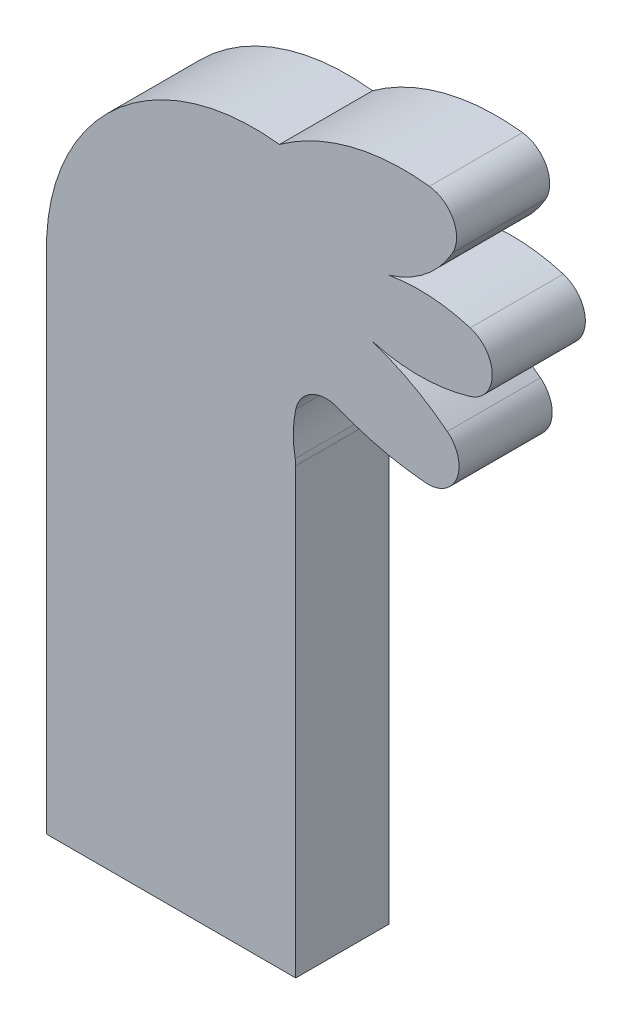
ISO-10303-21;
HEADER;
FILE_DESCRIPTION(('STEP AP214'),'2;1');
FILE_NAME('part.step','',(''),(''),'','','');
FILE_SCHEMA(('AUTOMOTIVE_DESIGN { 1 0 10303 214 1 1 1 1 }'));
ENDSEC;
DATA;
#1=APPLICATION_CONTEXT('core data for automotive mechanical design processes');
#2=APPLICATION_PROTOCOL_DEFINITION('international standard','automotive_design',2000,#1);
#3=PRODUCT_CONTEXT('',#1,'mechanical');
#4=PRODUCT('Part','Part','',(#3));
#5=PRODUCT_RELATED_PRODUCT_CATEGORY('part','',(#4));
#6=PRODUCT_DEFINITION_FORMATION('','',#4);
#7=PRODUCT_DEFINITION_CONTEXT('part definition',#1,'design');
#8=PRODUCT_DEFINITION('design','',#6,#7);
#9=PRODUCT_DEFINITION_SHAPE('','',#8);
#10=(LENGTH_UNIT() NAMED_UNIT(*) SI_UNIT(.MILLI.,.METRE.));
#11=(NAMED_UNIT(*) PLANE_ANGLE_UNIT() SI_UNIT($,.RADIAN.));
#12=(NAMED_UNIT(*) SI_UNIT($,.STERADIAN.) SOLID_ANGLE_UNIT());
#13=UNCERTAINTY_MEASURE_WITH_UNIT(LENGTH_MEASURE(1.E-05),#10,'distance_accuracy_value','');
#14=(GEOMETRIC_REPRESENTATION_CONTEXT(3) GLOBAL_UNCERTAINTY_ASSIGNED_CONTEXT((#13)) GLOBAL_UNIT_ASSIGNED_CONTEXT((#10,
#11,#12)) REPRESENTATION_CONTEXT('',''));
#15=CARTESIAN_POINT('',(0.,0.,0.));
#16=DIRECTION('',(0.,0.,1.));
#17=DIRECTION('',(1.,0.,0.));
#18=AXIS2_PLACEMENT_3D('',#15,#16,#17);
#19=CARTESIAN_POINT('',(13.7145077739251,-21.6016683174806,3.));
#20=DIRECTION('',(0.,0.,-1.));
#21=DIRECTION('',(-1.,0.,0.));
#22=AXIS2_PLACEMENT_3D('',#19,#20,#21);
#23=CYLINDRICAL_SURFACE('',#22,5.70087712549573);
#24=CARTESIAN_POINT('',(13.7145077739251,-21.6016683174806,0.));
#25=DIRECTION('',(0.,0.,1.));
#26=DIRECTION('',(1.,0.,0.));
#27=AXIS2_PLACEMENT_3D('',#24,#25,#26);
#28=CIRCLE('',#27,5.70087712549573);
#29=CARTESIAN_POINT('',(12.2145077739251,-27.1016683174806,0.));
#30=VERTEX_POINT('',#29);
#31=CARTESIAN_POINT('',(15.3632115742729,-27.0589364782657,0.));
#32=VERTEX_POINT('',#31);
#33=EDGE_CURVE('E178',#30,#32,#28,.T.);
#34=ORIENTED_EDGE('',*,*,#33,.T.);
#35=DIRECTION('',(0.,0.,-1.));
#36=VECTOR('',#35,1.);
#37=CARTESIAN_POINT('',(15.3632115742729,-27.0589364782657,3.));
#38=LINE('',#37,#36);
#39=CARTESIAN_POINT('',(15.3632115742729,-27.0589364782657,3.));
#40=VERTEX_POINT('',#39);
#41=EDGE_CURVE('E11',#40,#32,#38,.T.);
#42=ORIENTED_EDGE('',*,*,#41,.F.);
#43=CARTESIAN_POINT('',(13.7145077739251,-21.6016683174806,3.));
#44=DIRECTION('',(0.,0.,1.));
#45=DIRECTION('',(1.,0.,0.));
#46=AXIS2_PLACEMENT_3D('',#43,#44,#45);
#47=CIRCLE('',#46,5.70087712549573);
#48=CARTESIAN_POINT('',(12.2145077739251,-27.1016683174806,3.));
#49=VERTEX_POINT('',#48);
#50=EDGE_CURVE('E208',#49,#40,#47,.T.);
#51=ORIENTED_EDGE('',*,*,#50,.F.);
#52=DIRECTION('',(0.,0.,-1.));
#53=VECTOR('',#52,1.);
#54=CARTESIAN_POINT('',(12.2145077739251,-27.1016683174806,3.));
#55=LINE('',#54,#53);
#56=EDGE_CURVE('E174',#49,#30,#55,.T.);
#57=ORIENTED_EDGE('',*,*,#56,.T.);
#58=EDGE_LOOP('',(#34,#42,#51,#57));
#59=FACE_BOUND('',#58,.T.);
#60=ADVANCED_FACE('F34',(#59),#23,.T.);
#61=CARTESIAN_POINT('',(15.0740097963615,-26.1016683174806,3.));
#62=DIRECTION('',(0.,0.,-1.));
#63=DIRECTION('',(-1.,0.,0.));
#64=AXIS2_PLACEMENT_3D('',#61,#62,#63);
#65=CYLINDRICAL_SURFACE('',#64,1.00000000000001);
#66=CARTESIAN_POINT('',(15.0740097963615,-26.1016683174806,0.));
#67=DIRECTION('',(0.,0.,1.));
#68=DIRECTION('',(1.,0.,0.));
#69=AXIS2_PLACEMENT_3D('',#66,#67,#68);
#70=CIRCLE('',#69,1.00000000000001);
#71=CARTESIAN_POINT('',(15.3632115742729,-25.1444001566955,0.));
#72=VERTEX_POINT('',#71);
#73=EDGE_CURVE('E181',#32,#72,#70,.T.);
#74=ORIENTED_EDGE('',*,*,#73,.T.);
#75=DIRECTION('',(0.,0.,-1.));
#76=VECTOR('',#75,1.);
#77=CARTESIAN_POINT('',(15.3632115742729,-25.1444001566955,3.));
#78=LINE('',#77,#76);
#79=CARTESIAN_POINT('',(15.3632115742729,-25.1444001566955,3.));
#80=VERTEX_POINT('',#79);
#81=EDGE_CURVE('E42',#80,#72,#78,.T.);
#82=ORIENTED_EDGE('',*,*,#81,.F.);
#83=CARTESIAN_POINT('',(15.0740097963615,-26.1016683174806,3.));
#84=DIRECTION('',(0.,0.,1.));
#85=DIRECTION('',(1.,0.,0.));
#86=AXIS2_PLACEMENT_3D('',#83,#84,#85);
#87=CIRCLE('',#86,1.00000000000001);
#88=EDGE_CURVE('E117',#40,#80,#87,.T.);
#89=ORIENTED_EDGE('',*,*,#88,.F.);
#90=ORIENTED_EDGE('',*,*,#41,.T.);
#91=EDGE_LOOP('',(#74,#82,#89,#90));
#92=FACE_BOUND('',#91,.T.);
#93=ADVANCED_FACE('F306',(#92),#65,.T.);
#94=CARTESIAN_POINT('',(13.7145077739251,-30.6016683174806,3.));
#95=DIRECTION('',(0.,0.,-1.));
#96=DIRECTION('',(-1.,0.,0.));
#97=AXIS2_PLACEMENT_3D('',#94,#95,#96);
#98=CYLINDRICAL_SURFACE('',#97,5.7008771254957);
#99=CARTESIAN_POINT('',(13.7145077739251,-30.6016683174806,0.));
#100=DIRECTION('',(0.,0.,1.));
#101=DIRECTION('',(1.,0.,0.));
#102=AXIS2_PLACEMENT_3D('',#99,#100,#101);
#103=CIRCLE('',#102,5.7008771254957);
#104=CARTESIAN_POINT('',(12.743919538631,-24.9840212586571,0.));
#105=VERTEX_POINT('',#104);
#106=EDGE_CURVE('E183',#72,#105,#103,.T.);
#107=ORIENTED_EDGE('',*,*,#106,.T.);
#108=DIRECTION('',(0.,0.,-1.));
#109=VECTOR('',#108,1.);
#110=CARTESIAN_POINT('',(12.743919538631,-24.9840212586571,3.));
#111=LINE('',#110,#109);
#112=CARTESIAN_POINT('',(12.743919538631,-24.9840212586571,3.));
#113=VERTEX_POINT('',#112);
#114=EDGE_CURVE('E239',#113,#105,#111,.T.);
#115=ORIENTED_EDGE('',*,*,#114,.F.);
#116=CARTESIAN_POINT('',(13.7145077739251,-30.6016683174806,3.));
#117=DIRECTION('',(0.,0.,1.));
#118=DIRECTION('',(1.,0.,0.));
#119=AXIS2_PLACEMENT_3D('',#116,#117,#118);
#120=CIRCLE('',#119,5.7008771254957);
#121=EDGE_CURVE('E247',#80,#113,#120,.T.);
#122=ORIENTED_EDGE('',*,*,#121,.F.);
#123=ORIENTED_EDGE('',*,*,#81,.T.);
#124=EDGE_LOOP('',(#107,#115,#122,#123));
#125=FACE_BOUND('',#124,.T.);
#126=ADVANCED_FACE('F245',(#125),#98,.T.);
#127=CARTESIAN_POINT('',(11.7145077739251,-21.6016683174806,3.));
#128=DIRECTION('',(0.,0.,-1.));
#129=DIRECTION('',(-1.,0.,0.));
#130=AXIS2_PLACEMENT_3D('',#127,#128,#129);
#131=CYLINDRICAL_SURFACE('',#130,3.53553390593272);
#132=CARTESIAN_POINT('',(11.7145077739251,-21.6016683174806,0.));
#133=DIRECTION('',(0.,0.,1.));
#134=DIRECTION('',(1.,0.,0.));
#135=AXIS2_PLACEMENT_3D('',#132,#133,#134);
#136=CIRCLE('',#135,3.53553390593272);
#137=CARTESIAN_POINT('',(14.7961430373167,-23.3347361474922,0.));
#138=VERTEX_POINT('',#137);
#139=EDGE_CURVE('E185',#105,#138,#136,.T.);
#140=ORIENTED_EDGE('',*,*,#139,.T.);
#141=DIRECTION('',(0.,0.,-1.));
#142=VECTOR('',#141,1.);
#143=CARTESIAN_POINT('',(14.7961430373167,-23.3347361474922,3.));
#144=LINE('',#143,#142);
#145=CARTESIAN_POINT('',(14.7961430373167,-23.3347361474922,3.));
#146=VERTEX_POINT('',#145);
#147=EDGE_CURVE('E236',#146,#138,#144,.T.);
#148=ORIENTED_EDGE('',*,*,#147,.F.);
#149=CARTESIAN_POINT('',(11.7145077739251,-21.6016683174806,3.));
#150=DIRECTION('',(0.,0.,1.));
#151=DIRECTION('',(1.,0.,0.));
#152=AXIS2_PLACEMENT_3D('',#149,#150,#151);
#153=CIRCLE('',#152,3.53553390593272);
#154=EDGE_CURVE('E265',#113,#146,#153,.T.);
#155=ORIENTED_EDGE('',*,*,#154,.F.);
#156=ORIENTED_EDGE('',*,*,#114,.T.);
#157=EDGE_LOOP('',(#140,#148,#155,#156));
#158=FACE_BOUND('',#157,.T.);
#159=ADVANCED_FACE('F256',(#158),#131,.T.);
#160=CARTESIAN_POINT('',(13.9245249605616,-22.8445505415492,3.));
#161=DIRECTION('',(0.,0.,-1.));
#162=DIRECTION('',(-1.,0.,0.));
#163=AXIS2_PLACEMENT_3D('',#160,#161,#162);
#164=CYLINDRICAL_SURFACE('',#163,1.00000000000001);
#165=CARTESIAN_POINT('',(13.9245249605616,-22.8445505415492,0.));
#166=DIRECTION('',(0.,0.,1.));
#167=DIRECTION('',(1.,0.,0.));
#168=AXIS2_PLACEMENT_3D('',#165,#166,#167);
#169=CIRCLE('',#168,1.00000000000001);
#170=CARTESIAN_POINT('',(14.0469262003186,-21.8520698432452,0.));
#171=VERTEX_POINT('',#170);
#172=EDGE_CURVE('E187',#138,#171,#169,.T.);
#173=ORIENTED_EDGE('',*,*,#172,.T.);
#174=DIRECTION('',(0.,0.,-1.));
#175=VECTOR('',#174,1.);
#176=CARTESIAN_POINT('',(14.0469262003186,-21.8520698432452,3.));
#177=LINE('',#176,#175);
#178=CARTESIAN_POINT('',(14.0469262003186,-21.8520698432452,3.));
#179=VERTEX_POINT('',#178);
#180=EDGE_CURVE('E233',#179,#171,#177,.T.);
#181=ORIENTED_EDGE('',*,*,#180,.F.);
#182=CARTESIAN_POINT('',(13.9245249605616,-22.8445505415492,3.));
#183=DIRECTION('',(0.,0.,1.));
#184=DIRECTION('',(1.,0.,0.));
#185=AXIS2_PLACEMENT_3D('',#182,#183,#184);
#186=CIRCLE('',#185,1.00000000000001);
#187=EDGE_CURVE('E262',#146,#179,#186,.T.);
#188=ORIENTED_EDGE('',*,*,#187,.F.);
#189=ORIENTED_EDGE('',*,*,#147,.T.);
#190=EDGE_LOOP('',(#173,#181,#188,#189));
#191=FACE_BOUND('',#190,.T.);
#192=ADVANCED_FACE('F260',(#191),#164,.T.);
#193=CARTESIAN_POINT('',(13.2145077739251,-28.6016683174806,3.));
#194=DIRECTION('',(0.,0.,-1.));
#195=DIRECTION('',(-1.,0.,0.));
#196=AXIS2_PLACEMENT_3D('',#193,#194,#195);
#197=CYLINDRICAL_SURFACE('',#196,6.8007352543677);
#198=CARTESIAN_POINT('',(13.2145077739251,-28.6016683174806,0.));
#199=DIRECTION('',(0.,0.,1.));
#200=DIRECTION('',(1.,0.,0.));
#201=AXIS2_PLACEMENT_3D('',#198,#199,#200);
#202=CIRCLE('',#201,6.8007352543677);
#203=CARTESIAN_POINT('',(9.21450777392509,-23.1016683174806,0.));
#204=VERTEX_POINT('',#203);
#205=EDGE_CURVE('E189',#171,#204,#202,.T.);
#206=ORIENTED_EDGE('',*,*,#205,.T.);
#207=DIRECTION('',(0.,0.,-1.));
#208=VECTOR('',#207,1.);
#209=CARTESIAN_POINT('',(9.21450777392509,-23.1016683174806,3.));
#210=LINE('',#209,#208);
#211=CARTESIAN_POINT('',(9.21450777392509,-23.1016683174806,3.));
#212=VERTEX_POINT('',#211);
#213=EDGE_CURVE('E230',#212,#204,#210,.T.);
#214=ORIENTED_EDGE('',*,*,#213,.F.);
#215=CARTESIAN_POINT('',(13.2145077739251,-28.6016683174806,3.));
#216=DIRECTION('',(0.,0.,1.));
#217=DIRECTION('',(1.,0.,0.));
#218=AXIS2_PLACEMENT_3D('',#215,#216,#217);
#219=CIRCLE('',#218,6.8007352543677);
#220=EDGE_CURVE('E264',#179,#212,#219,.T.);
#221=ORIENTED_EDGE('',*,*,#220,.F.);
#222=ORIENTED_EDGE('',*,*,#180,.T.);
#223=EDGE_LOOP('',(#206,#214,#221,#222));
#224=FACE_BOUND('',#223,.T.);
#225=ADVANCED_FACE('F319',(#224),#197,.T.);
#226=CARTESIAN_POINT('',(8.3950273914032,-29.738679173419,3.));
#227=DIRECTION('',(0.,0.,-1.));
#228=DIRECTION('',(-1.,0.,0.));
#229=AXIS2_PLACEMENT_3D('',#226,#227,#228);
#230=CYLINDRICAL_SURFACE('',#229,6.68741064980927);
#231=CARTESIAN_POINT('',(8.3950273914032,-29.738679173419,0.));
#232=DIRECTION('',(0.,0.,1.));
#233=DIRECTION('',(1.,0.,0.));
#234=AXIS2_PLACEMENT_3D('',#231,#232,#233);
#235=CIRCLE('',#234,6.68741064980927);
#236=CARTESIAN_POINT('',(1.71450777392508,-29.4351683174806,0.));
#237=VERTEX_POINT('',#236);
#238=EDGE_CURVE('E191',#204,#237,#235,.T.);
#239=ORIENTED_EDGE('',*,*,#238,.T.);
#240=DIRECTION('',(0.,0.,-1.));
#241=VECTOR('',#240,1.);
#242=CARTESIAN_POINT('',(1.71450777392508,-29.4351683174806,3.));
#243=LINE('',#242,#241);
#244=CARTESIAN_POINT('',(1.71450777392508,-29.4351683174806,3.));
#245=VERTEX_POINT('',#244);
#246=EDGE_CURVE('E227',#245,#237,#243,.T.);
#247=ORIENTED_EDGE('',*,*,#246,.F.);
#248=CARTESIAN_POINT('',(8.3950273914032,-29.738679173419,3.));
#249=DIRECTION('',(0.,0.,1.));
#250=DIRECTION('',(1.,0.,0.));
#251=AXIS2_PLACEMENT_3D('',#248,#249,#250);
#252=CIRCLE('',#251,6.68741064980927);
#253=EDGE_CURVE('E267',#212,#245,#252,.T.);
#254=ORIENTED_EDGE('',*,*,#253,.F.);
#255=ORIENTED_EDGE('',*,*,#213,.T.);
#256=EDGE_LOOP('',(#239,#247,#254,#255));
#257=FACE_BOUND('',#256,.T.);
#258=ADVANCED_FACE('F322',(#257),#230,.T.);
#259=CARTESIAN_POINT('',(1.71450777392508,-29.4351683174806,3.));
#260=DIRECTION('',(1.,0.,0.));
#261=DIRECTION('',(0.,1.,0.));
#262=AXIS2_PLACEMENT_3D('',#259,#260,#261);
#263=PLANE('',#262);
#264=DIRECTION('',(0.,-1.,0.));
#265=VECTOR('',#264,1.);
#266=CARTESIAN_POINT('',(1.71450777392508,-29.4351683174806,0.));
#267=LINE('',#266,#265);
#268=CARTESIAN_POINT('',(1.71450777392509,-46.1016683174528,0.));
#269=VERTEX_POINT('',#268);
#270=EDGE_CURVE('E193',#237,#269,#267,.T.);
#271=ORIENTED_EDGE('',*,*,#270,.T.);
#272=DIRECTION('',(0.,0.,-1.));
#273=VECTOR('',#272,1.);
#274=CARTESIAN_POINT('',(1.71450777392509,-46.1016683174528,3.));
#275=LINE('',#274,#273);
#276=CARTESIAN_POINT('',(1.71450777392509,-46.1016683174528,3.));
#277=VERTEX_POINT('',#276);
#278=EDGE_CURVE('E224',#277,#269,#275,.T.);
#279=ORIENTED_EDGE('',*,*,#278,.F.);
#280=DIRECTION('',(0.,-1.,0.));
#281=VECTOR('',#280,1.);
#282=CARTESIAN_POINT('',(1.71450777392508,-29.4351683174806,3.));
#283=LINE('',#282,#281);
#284=EDGE_CURVE('E273',#245,#277,#283,.T.);
#285=ORIENTED_EDGE('',*,*,#284,.F.);
#286=ORIENTED_EDGE('',*,*,#246,.T.);
#287=EDGE_LOOP('',(#271,#279,#285,#286));
#288=FACE_BOUND('',#287,.T.);
#289=ADVANCED_FACE('F326',(#288),#263,.F.);
#290=CARTESIAN_POINT('',(1.71450777392509,-46.1016683174528,3.));
#291=DIRECTION('',(3.46164873228199E-12,1.,0.));
#292=DIRECTION('',(-1.,3.46164873228199E-12,0.));
#293=AXIS2_PLACEMENT_3D('',#290,#291,#292);
#294=PLANE('',#293);
#295=DIRECTION('',(1.,-3.46164873228199E-12,0.));
#296=VECTOR('',#295,1.);
#297=CARTESIAN_POINT('',(1.71450777392509,-46.1016683174528,0.));
#298=LINE('',#297,#296);
#299=CARTESIAN_POINT('',(9.74054777392509,-46.1016683174806,0.));
#300=VERTEX_POINT('',#299);
#301=EDGE_CURVE('E195',#269,#300,#298,.T.);
#302=ORIENTED_EDGE('',*,*,#301,.T.);
#303=DIRECTION('',(0.,0.,-1.));
#304=VECTOR('',#303,1.);
#305=CARTESIAN_POINT('',(9.74054777392509,-46.1016683174806,3.));
#306=LINE('',#305,#304);
#307=CARTESIAN_POINT('',(9.74054777392509,-46.1016683174806,3.));
#308=VERTEX_POINT('',#307);
#309=EDGE_CURVE('E221',#308,#300,#306,.T.);
#310=ORIENTED_EDGE('',*,*,#309,.F.);
#311=DIRECTION('',(1.,-3.46164873228199E-12,0.));
#312=VECTOR('',#311,1.);
#313=CARTESIAN_POINT('',(1.71450777392509,-46.1016683174528,3.));
#314=LINE('',#313,#312);
#315=EDGE_CURVE('E275',#277,#308,#314,.T.);
#316=ORIENTED_EDGE('',*,*,#315,.F.);
#317=ORIENTED_EDGE('',*,*,#278,.T.);
#318=EDGE_LOOP('',(#302,#310,#316,#317));
#319=FACE_BOUND('',#318,.T.);
#320=ADVANCED_FACE('F330',(#319),#294,.F.);
#321=CARTESIAN_POINT('',(9.74054777392509,-46.1016683174806,3.));
#322=DIRECTION('',(-1.,0.,0.));
#323=DIRECTION('',(0.,0.,1.));
#324=AXIS2_PLACEMENT_3D('',#321,#322,#323);
#325=PLANE('',#324);
#326=DIRECTION('',(0.,1.,0.));
#327=VECTOR('',#326,1.);
#328=CARTESIAN_POINT('',(9.74054777392509,-46.1016683174806,0.));
#329=LINE('',#328,#327);
#330=CARTESIAN_POINT('',(9.74054777392509,-31.8032952783906,0.));
#331=VERTEX_POINT('',#330);
#332=EDGE_CURVE('E197',#300,#331,#329,.T.);
#333=ORIENTED_EDGE('',*,*,#332,.T.);
#334=DIRECTION('',(0.,0.,-1.));
#335=VECTOR('',#334,1.);
#336=CARTESIAN_POINT('',(9.74054777392509,-31.8032952783906,3.));
#337=LINE('',#336,#335);
#338=CARTESIAN_POINT('',(9.74054777392509,-31.8032952783906,3.));
#339=VERTEX_POINT('',#338);
#340=EDGE_CURVE('E218',#339,#331,#337,.T.);
#341=ORIENTED_EDGE('',*,*,#340,.F.);
#342=DIRECTION('',(0.,1.,0.));
#343=VECTOR('',#342,1.);
#344=CARTESIAN_POINT('',(9.74054777392509,-46.1016683174806,3.));
#345=LINE('',#344,#343);
#346=EDGE_CURVE('E277',#308,#339,#345,.T.);
#347=ORIENTED_EDGE('',*,*,#346,.F.);
#348=ORIENTED_EDGE('',*,*,#309,.T.);
#349=EDGE_LOOP('',(#333,#341,#347,#348));
#350=FACE_BOUND('',#349,.T.);
#351=ADVANCED_FACE('F334',(#350),#325,.F.);
#352=CARTESIAN_POINT('',(8.74054777392506,-31.8032952783907,3.));
#353=DIRECTION('',(0.,0.,-1.));
#354=DIRECTION('',(-1.,0.,0.));
#355=AXIS2_PLACEMENT_3D('',#352,#353,#354);
#356=CYLINDRICAL_SURFACE('',#355,1.00000000000003);
#357=CARTESIAN_POINT('',(8.74054777392506,-31.8032952783907,0.));
#358=DIRECTION('',(0.,0.,1.));
#359=DIRECTION('',(1.,0.,0.));
#360=AXIS2_PLACEMENT_3D('',#357,#358,#359);
#361=CIRCLE('',#360,1.00000000000003);
#362=CARTESIAN_POINT('',(9.72261802795543,-31.6147799841868,0.));
#363=VERTEX_POINT('',#362);
#364=EDGE_CURVE('E199',#331,#363,#361,.T.);
#365=ORIENTED_EDGE('',*,*,#364,.T.);
#366=DIRECTION('',(0.,0.,-1.));
#367=VECTOR('',#366,1.);
#368=CARTESIAN_POINT('',(9.72261802795543,-31.6147799841868,3.));
#369=LINE('',#368,#367);
#370=CARTESIAN_POINT('',(9.72261802795543,-31.6147799841868,3.));
#371=VERTEX_POINT('',#370);
#372=EDGE_CURVE('E215',#371,#363,#369,.T.);
#373=ORIENTED_EDGE('',*,*,#372,.F.);
#374=CARTESIAN_POINT('',(8.74054777392506,-31.8032952783907,3.));
#375=DIRECTION('',(0.,0.,1.));
#376=DIRECTION('',(1.,0.,0.));
#377=AXIS2_PLACEMENT_3D('',#374,#375,#376);
#378=CIRCLE('',#377,1.00000000000003);
#379=EDGE_CURVE('E279',#339,#371,#378,.T.);
#380=ORIENTED_EDGE('',*,*,#379,.F.);
#381=ORIENTED_EDGE('',*,*,#340,.T.);
#382=EDGE_LOOP('',(#365,#373,#380,#381));
#383=FACE_BOUND('',#382,.T.);
#384=ADVANCED_FACE('F338',(#383),#356,.T.);
#385=CARTESIAN_POINT('',(13.0879526715442,-30.9687803239519,3.));
#386=DIRECTION('',(0.,0.,-1.));
#387=DIRECTION('',(-1.,0.,0.));
#388=AXIS2_PLACEMENT_3D('',#385,#386,#387);
#389=CYLINDRICAL_SURFACE('',#388,3.42677586433117);
#390=CARTESIAN_POINT('',(13.0879526715442,-30.9687803239519,0.));
#391=DIRECTION('',(0.,0.,-1.));
#392=DIRECTION('',(1.,0.,0.));
#393=AXIS2_PLACEMENT_3D('',#390,#391,#392);
#394=CIRCLE('',#393,3.42677586433117);
#395=CARTESIAN_POINT('',(9.74377248523489,-30.2209489887842,0.));
#396=VERTEX_POINT('',#395);
#397=EDGE_CURVE('E201',#363,#396,#394,.T.);
#398=ORIENTED_EDGE('',*,*,#397,.T.);
#399=DIRECTION('',(0.,0.,-1.));
#400=VECTOR('',#399,1.);
#401=CARTESIAN_POINT('',(9.74377248523489,-30.2209489887842,3.));
#402=LINE('',#401,#400);
#403=CARTESIAN_POINT('',(9.74377248523489,-30.2209489887842,3.));
#404=VERTEX_POINT('',#403);
#405=EDGE_CURVE('E212',#404,#396,#402,.T.);
#406=ORIENTED_EDGE('',*,*,#405,.F.);
#407=CARTESIAN_POINT('',(13.0879526715442,-30.9687803239519,3.));
#408=DIRECTION('',(0.,0.,-1.));
#409=DIRECTION('',(1.,0.,0.));
#410=AXIS2_PLACEMENT_3D('',#407,#408,#409);
#411=CIRCLE('',#410,3.42677586433117);
#412=EDGE_CURVE('E281',#371,#404,#411,.T.);
#413=ORIENTED_EDGE('',*,*,#412,.F.);
#414=ORIENTED_EDGE('',*,*,#372,.T.);
#415=EDGE_LOOP('',(#398,#406,#413,#414));
#416=FACE_BOUND('',#415,.T.);
#417=ADVANCED_FACE('F287',(#416),#389,.F.);
#418=CARTESIAN_POINT('',(10.7196694562386,-30.4391807508763,3.));
#419=DIRECTION('',(0.,0.,-1.));
#420=DIRECTION('',(-1.,0.,0.));
#421=AXIS2_PLACEMENT_3D('',#418,#419,#420);
#422=CYLINDRICAL_SURFACE('',#421,0.999999999999998);
#423=CARTESIAN_POINT('',(10.7196694562386,-30.4391807508763,0.));
#424=DIRECTION('',(0.,0.,-1.));
#425=DIRECTION('',(1.,0.,0.));
#426=AXIS2_PLACEMENT_3D('',#423,#424,#425);
#427=CIRCLE('',#426,0.999999999999998);
#428=CARTESIAN_POINT('',(11.0959130227392,-29.5126599585209,0.));
#429=VERTEX_POINT('',#428);
#430=EDGE_CURVE('E203',#396,#429,#427,.T.);
#431=ORIENTED_EDGE('',*,*,#430,.T.);
#432=DIRECTION('',(0.,0.,-1.));
#433=VECTOR('',#432,1.);
#434=CARTESIAN_POINT('',(11.0959130227392,-29.5126599585209,3.));
#435=LINE('',#434,#433);
#436=CARTESIAN_POINT('',(11.0959130227392,-29.5126599585209,3.));
#437=VERTEX_POINT('',#436);
#438=EDGE_CURVE('E169',#437,#429,#435,.T.);
#439=ORIENTED_EDGE('',*,*,#438,.F.);
#440=CARTESIAN_POINT('',(10.7196694562386,-30.4391807508763,3.));
#441=DIRECTION('',(0.,0.,-1.));
#442=DIRECTION('',(1.,0.,0.));
#443=AXIS2_PLACEMENT_3D('',#440,#441,#442);
#444=CIRCLE('',#443,0.999999999999998);
#445=EDGE_CURVE('E160',#404,#437,#444,.T.);
#446=ORIENTED_EDGE('',*,*,#445,.F.);
#447=ORIENTED_EDGE('',*,*,#405,.T.);
#448=EDGE_LOOP('',(#431,#439,#446,#447));
#449=FACE_BOUND('',#448,.T.);
#450=ADVANCED_FACE('F291',(#449),#422,.F.);
#451=CARTESIAN_POINT('',(14.714507773925,-20.6016683174807,3.));
#452=DIRECTION('',(0.,0.,-1.));
#453=DIRECTION('',(-1.,0.,0.));
#454=AXIS2_PLACEMENT_3D('',#451,#452,#453);
#455=CYLINDRICAL_SURFACE('',#454,9.61769203083562);
#456=CARTESIAN_POINT('',(14.714507773925,-20.6016683174807,0.));
#457=DIRECTION('',(0.,0.,1.));
#458=DIRECTION('',(1.,0.,0.));
#459=AXIS2_PLACEMENT_3D('',#456,#457,#458);
#460=CIRCLE('',#459,9.61769203083562);
#461=CARTESIAN_POINT('',(13.9219789853226,-30.1866512657824,0.));
#462=VERTEX_POINT('',#461);
#463=EDGE_CURVE('E168',#429,#462,#460,.T.);
#464=ORIENTED_EDGE('',*,*,#463,.T.);
#465=DIRECTION('',(0.,0.,-1.));
#466=VECTOR('',#465,1.);
#467=CARTESIAN_POINT('',(13.9219789853226,-30.1866512657824,3.));
#468=LINE('',#467,#466);
#469=CARTESIAN_POINT('',(13.9219789853226,-30.1866512657824,3.));
#470=VERTEX_POINT('',#469);
#471=EDGE_CURVE('E165',#470,#462,#468,.T.);
#472=ORIENTED_EDGE('',*,*,#471,.F.);
#473=CARTESIAN_POINT('',(14.714507773925,-20.6016683174807,3.));
#474=DIRECTION('',(0.,0.,1.));
#475=DIRECTION('',(1.,0.,0.));
#476=AXIS2_PLACEMENT_3D('',#473,#474,#475);
#477=CIRCLE('',#476,9.61769203083562);
#478=EDGE_CURVE('E154',#437,#470,#477,.T.);
#479=ORIENTED_EDGE('',*,*,#478,.F.);
#480=ORIENTED_EDGE('',*,*,#438,.T.);
#481=EDGE_LOOP('',(#464,#472,#479,#480));
#482=FACE_BOUND('',#481,.T.);
#483=ADVANCED_FACE('F166',(#482),#455,.T.);
#484=CARTESIAN_POINT('',(14.0043822049372,-29.190052194241,3.));
#485=DIRECTION('',(0.,0.,-1.));
#486=DIRECTION('',(-1.,0.,0.));
#487=AXIS2_PLACEMENT_3D('',#484,#485,#486);
#488=CYLINDRICAL_SURFACE('',#487,0.999999999999997);
#489=CARTESIAN_POINT('',(14.0043822049372,-29.190052194241,0.));
#490=DIRECTION('',(0.,0.,1.));
#491=DIRECTION('',(1.,0.,0.));
#492=AXIS2_PLACEMENT_3D('',#489,#490,#491);
#493=CIRCLE('',#492,0.999999999999997);
#494=CARTESIAN_POINT('',(14.6255904915438,-28.4064066974433,0.));
#495=VERTEX_POINT('',#494);
#496=EDGE_CURVE('E103',#462,#495,#493,.T.);
#497=ORIENTED_EDGE('',*,*,#496,.T.);
#498=DIRECTION('',(0.,0.,-1.));
#499=VECTOR('',#498,1.);
#500=CARTESIAN_POINT('',(14.6255904915438,-28.4064066974433,3.));
#501=LINE('',#500,#499);
#502=CARTESIAN_POINT('',(14.6255904915438,-28.4064066974433,3.));
#503=VERTEX_POINT('',#502);
#504=EDGE_CURVE('E170',#503,#495,#501,.T.);
#505=ORIENTED_EDGE('',*,*,#504,.F.);
#506=CARTESIAN_POINT('',(14.0043822049372,-29.190052194241,3.));
#507=DIRECTION('',(0.,0.,1.));
#508=DIRECTION('',(1.,0.,0.));
#509=AXIS2_PLACEMENT_3D('',#506,#507,#508);
#510=CIRCLE('',#509,0.999999999999997);
#511=EDGE_CURVE('E158',#470,#503,#510,.T.);
#512=ORIENTED_EDGE('',*,*,#511,.F.);
#513=ORIENTED_EDGE('',*,*,#471,.T.);
#514=EDGE_LOOP('',(#497,#505,#512,#513));
#515=FACE_BOUND('',#514,.T.);
#516=ADVANCED_FACE('F172',(#515),#488,.T.);
#517=CARTESIAN_POINT('',(9.71450777392512,-34.6016683174806,3.));
#518=DIRECTION('',(0.,0.,-1.));
#519=DIRECTION('',(-1.,0.,0.));
#520=AXIS2_PLACEMENT_3D('',#517,#518,#519);
#521=CYLINDRICAL_SURFACE('',#520,7.90569415042092);
#522=CARTESIAN_POINT('',(9.71450777392512,-34.6016683174806,0.));
#523=DIRECTION('',(0.,0.,1.));
#524=DIRECTION('',(1.,0.,0.));
#525=AXIS2_PLACEMENT_3D('',#522,#523,#524);
#526=CIRCLE('',#525,7.90569415042092);
#527=EDGE_CURVE('E109',#495,#30,#526,.T.);
#528=ORIENTED_EDGE('',*,*,#527,.T.);
#529=ORIENTED_EDGE('',*,*,#56,.F.);
#530=CARTESIAN_POINT('',(9.71450777392512,-34.6016683174806,3.));
#531=DIRECTION('',(0.,0.,1.));
#532=DIRECTION('',(1.,0.,0.));
#533=AXIS2_PLACEMENT_3D('',#530,#531,#532);
#534=CIRCLE('',#533,7.90569415042092);
#535=EDGE_CURVE('E50',#503,#49,#534,.T.);
#536=ORIENTED_EDGE('',*,*,#535,.F.);
#537=ORIENTED_EDGE('',*,*,#504,.T.);
#538=EDGE_LOOP('',(#528,#529,#536,#537));
#539=FACE_BOUND('',#538,.T.);
#540=ADVANCED_FACE('F295',(#539),#521,.T.);
#541=CARTESIAN_POINT('',(13.7145077739251,-21.6016683174806,3.));
#542=DIRECTION('',(0.,0.,1.));
#543=DIRECTION('',(1.,0.,0.));
#544=AXIS2_PLACEMENT_3D('',#541,#542,#543);
#545=PLANE('',#544);
#546=ORIENTED_EDGE('',*,*,#50,.T.);
#547=ORIENTED_EDGE('',*,*,#88,.T.);
#548=ORIENTED_EDGE('',*,*,#121,.T.);
#549=ORIENTED_EDGE('',*,*,#154,.T.);
#550=ORIENTED_EDGE('',*,*,#187,.T.);
#551=ORIENTED_EDGE('',*,*,#220,.T.);
#552=ORIENTED_EDGE('',*,*,#253,.T.);
#553=ORIENTED_EDGE('',*,*,#284,.T.);
#554=ORIENTED_EDGE('',*,*,#315,.T.);
#555=ORIENTED_EDGE('',*,*,#346,.T.);
#556=ORIENTED_EDGE('',*,*,#379,.T.);
#557=ORIENTED_EDGE('',*,*,#412,.T.);
#558=ORIENTED_EDGE('',*,*,#445,.T.);
#559=ORIENTED_EDGE('',*,*,#478,.T.);
#560=ORIENTED_EDGE('',*,*,#511,.T.);
#561=ORIENTED_EDGE('',*,*,#535,.T.);
#562=EDGE_LOOP('',(#546,#547,#548,#549,#550,#551,#552,#553,#554,#555,#556,#557,#558,#559,#560,#561));
#563=FACE_BOUND('',#562,.T.);
#564=ADVANCED_FACE('F156',(#563),#545,.T.);
#565=CARTESIAN_POINT('',(13.7145077739251,-21.6016683174806,0.));
#566=DIRECTION('',(0.,0.,1.));
#567=DIRECTION('',(1.,0.,0.));
#568=AXIS2_PLACEMENT_3D('',#565,#566,#567);
#569=PLANE('',#568);
#570=ORIENTED_EDGE('',*,*,#33,.F.);
#571=ORIENTED_EDGE('',*,*,#527,.F.);
#572=ORIENTED_EDGE('',*,*,#496,.F.);
#573=ORIENTED_EDGE('',*,*,#463,.F.);
#574=ORIENTED_EDGE('',*,*,#430,.F.);
#575=ORIENTED_EDGE('',*,*,#397,.F.);
#576=ORIENTED_EDGE('',*,*,#364,.F.);
#577=ORIENTED_EDGE('',*,*,#332,.F.);
#578=ORIENTED_EDGE('',*,*,#301,.F.);
#579=ORIENTED_EDGE('',*,*,#270,.F.);
#580=ORIENTED_EDGE('',*,*,#238,.F.);
#581=ORIENTED_EDGE('',*,*,#205,.F.);
#582=ORIENTED_EDGE('',*,*,#172,.F.);
#583=ORIENTED_EDGE('',*,*,#139,.F.);
#584=ORIENTED_EDGE('',*,*,#106,.F.);
#585=ORIENTED_EDGE('',*,*,#73,.F.);
#586=EDGE_LOOP('',(#570,#571,#572,#573,#574,#575,#576,#577,#578,#579,#580,#581,#582,#583,#584,#585));
#587=FACE_BOUND('',#586,.T.);
#588=ADVANCED_FACE('F251',(#587),#569,.F.);
#589=CLOSED_SHELL('',(#60,#93,#126,#159,#192,#225,#258,#289,#320,#351,#384,#417,#450,#483,#516,
#540,#564,#588));
#590=MANIFOLD_SOLID_BREP('B2',#589);
#591=ADVANCED_BREP_SHAPE_REPRESENTATION('',(#18,#590),#14);
#592=SHAPE_DEFINITION_REPRESENTATION(#9,#591);
ENDSEC;
END-ISO-10303-21;
